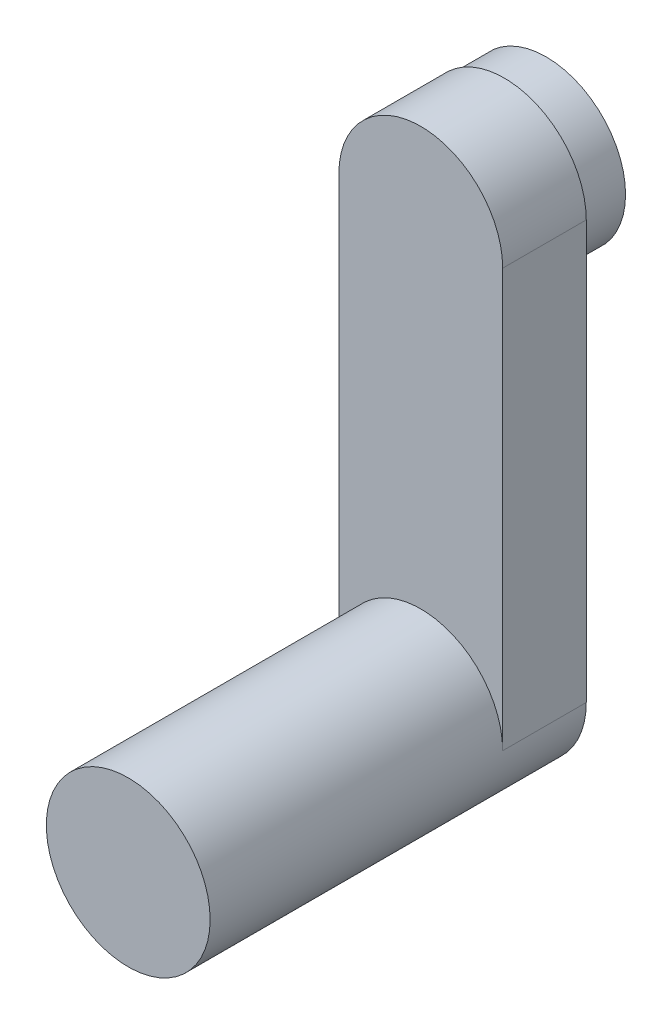
ISO-10303-21;
HEADER;
FILE_DESCRIPTION(('STEP AP214'),'2;1');
FILE_NAME('part.step','',(''),(''),'','','');
FILE_SCHEMA(('AUTOMOTIVE_DESIGN { 1 0 10303 214 1 1 1 1 }'));
ENDSEC;
DATA;
#1=APPLICATION_CONTEXT('core data for automotive mechanical design processes');
#2=APPLICATION_PROTOCOL_DEFINITION('international standard','automotive_design',2000,#1);
#3=PRODUCT_CONTEXT('',#1,'mechanical');
#4=PRODUCT('Part','Part','',(#3));
#5=PRODUCT_RELATED_PRODUCT_CATEGORY('part','',(#4));
#6=PRODUCT_DEFINITION_FORMATION('','',#4);
#7=PRODUCT_DEFINITION_CONTEXT('part definition',#1,'design');
#8=PRODUCT_DEFINITION('design','',#6,#7);
#9=PRODUCT_DEFINITION_SHAPE('','',#8);
#10=(LENGTH_UNIT() NAMED_UNIT(*) SI_UNIT(.MILLI.,.METRE.));
#11=(NAMED_UNIT(*) PLANE_ANGLE_UNIT() SI_UNIT($,.RADIAN.));
#12=(NAMED_UNIT(*) SI_UNIT($,.STERADIAN.) SOLID_ANGLE_UNIT());
#13=UNCERTAINTY_MEASURE_WITH_UNIT(LENGTH_MEASURE(1.E-05),#10,'distance_accuracy_value','');
#14=(GEOMETRIC_REPRESENTATION_CONTEXT(3) GLOBAL_UNCERTAINTY_ASSIGNED_CONTEXT((#13)) GLOBAL_UNIT_ASSIGNED_CONTEXT((#10,
#11,#12)) REPRESENTATION_CONTEXT('',''));
#15=CARTESIAN_POINT('',(0.,0.,0.));
#16=DIRECTION('',(0.,0.,1.));
#17=DIRECTION('',(1.,0.,0.));
#18=AXIS2_PLACEMENT_3D('',#15,#16,#17);
#19=CARTESIAN_POINT('',(0.,0.,175.));
#20=DIRECTION('',(0.,0.,-1.));
#21=DIRECTION('',(-1.,0.,0.));
#22=AXIS2_PLACEMENT_3D('',#19,#20,#21);
#23=CYLINDRICAL_SURFACE('',#22,49.);
#24=CARTESIAN_POINT('',(0.,0.,175.));
#25=DIRECTION('',(0.,0.,1.));
#26=DIRECTION('',(1.,0.,0.));
#27=AXIS2_PLACEMENT_3D('',#24,#25,#26);
#28=CIRCLE('',#27,49.);
#29=CARTESIAN_POINT('',(49.,0.,175.));
#30=VERTEX_POINT('',#29);
#31=EDGE_CURVE('E40',#30,#30,#28,.T.);
#32=ORIENTED_EDGE('',*,*,#31,.F.);
#33=EDGE_LOOP('',(#32));
#34=FACE_BOUND('',#33,.T.);
#35=CARTESIAN_POINT('',(0.,0.,0.));
#36=DIRECTION('',(0.,0.,1.));
#37=DIRECTION('',(1.,0.,0.));
#38=AXIS2_PLACEMENT_3D('',#35,#36,#37);
#39=CIRCLE('',#38,49.);
#40=CARTESIAN_POINT('',(49.,0.,0.));
#41=VERTEX_POINT('',#40);
#42=CARTESIAN_POINT('',(-49.,0.,0.));
#43=VERTEX_POINT('',#42);
#44=EDGE_CURVE('E107',#41,#43,#39,.T.);
#45=ORIENTED_EDGE('',*,*,#44,.T.);
#46=DIRECTION('',(0.,0.,1.));
#47=VECTOR('',#46,1.);
#48=CARTESIAN_POINT('',(-49.,0.,-50.));
#49=LINE('',#48,#47);
#50=CARTESIAN_POINT('',(-49.,0.,-50.));
#51=VERTEX_POINT('',#50);
#52=EDGE_CURVE('E91',#51,#43,#49,.T.);
#53=ORIENTED_EDGE('',*,*,#52,.F.);
#54=CARTESIAN_POINT('',(0.,0.,-50.));
#55=DIRECTION('',(0.,0.,-1.));
#56=DIRECTION('',(-1.,0.,0.));
#57=AXIS2_PLACEMENT_3D('',#54,#55,#56);
#58=CIRCLE('',#57,49.);
#59=CARTESIAN_POINT('',(49.,0.,-50.));
#60=VERTEX_POINT('',#59);
#61=EDGE_CURVE('E85',#60,#51,#58,.T.);
#62=ORIENTED_EDGE('',*,*,#61,.F.);
#63=DIRECTION('',(0.,0.,1.));
#64=VECTOR('',#63,1.);
#65=CARTESIAN_POINT('',(49.,0.,-50.));
#66=LINE('',#65,#64);
#67=EDGE_CURVE('E47',#60,#41,#66,.T.);
#68=ORIENTED_EDGE('',*,*,#67,.T.);
#69=EDGE_LOOP('',(#45,#53,#62,#68));
#70=FACE_BOUND('',#69,.T.);
#71=ADVANCED_FACE('F33',(#34,#70),#23,.T.);
#72=CARTESIAN_POINT('',(0.,0.,175.));
#73=DIRECTION('',(0.,0.,1.));
#74=DIRECTION('',(1.,0.,0.));
#75=AXIS2_PLACEMENT_3D('',#72,#73,#74);
#76=PLANE('',#75);
#77=ORIENTED_EDGE('',*,*,#31,.T.);
#78=EDGE_LOOP('',(#77));
#79=FACE_BOUND('',#78,.T.);
#80=ADVANCED_FACE('F142',(#79),#76,.T.);
#81=CARTESIAN_POINT('',(-49.,0.,-50.));
#82=DIRECTION('',(1.,0.,0.));
#83=DIRECTION('',(0.,0.,-1.));
#84=AXIS2_PLACEMENT_3D('',#81,#82,#83);
#85=PLANE('',#84);
#86=DIRECTION('',(0.,1.,0.));
#87=VECTOR('',#86,1.);
#88=CARTESIAN_POINT('',(-49.,0.,0.));
#89=LINE('',#88,#87);
#90=CARTESIAN_POINT('',(-49.,250.,0.));
#91=VERTEX_POINT('',#90);
#92=EDGE_CURVE('E90',#43,#91,#89,.T.);
#93=ORIENTED_EDGE('',*,*,#92,.T.);
#94=DIRECTION('',(0.,0.,1.));
#95=VECTOR('',#94,1.);
#96=CARTESIAN_POINT('',(-49.,250.,-50.));
#97=LINE('',#96,#95);
#98=CARTESIAN_POINT('',(-49.,250.,-50.));
#99=VERTEX_POINT('',#98);
#100=EDGE_CURVE('E88',#99,#91,#97,.T.);
#101=ORIENTED_EDGE('',*,*,#100,.F.);
#102=DIRECTION('',(0.,1.,0.));
#103=VECTOR('',#102,1.);
#104=CARTESIAN_POINT('',(-49.,0.,-50.));
#105=LINE('',#104,#103);
#106=EDGE_CURVE('E81',#51,#99,#105,.T.);
#107=ORIENTED_EDGE('',*,*,#106,.F.);
#108=ORIENTED_EDGE('',*,*,#52,.T.);
#109=EDGE_LOOP('',(#93,#101,#107,#108));
#110=FACE_BOUND('',#109,.T.);
#111=ADVANCED_FACE('F89',(#110),#85,.F.);
#112=CARTESIAN_POINT('',(0.,250.,-50.));
#113=DIRECTION('',(0.,0.,1.));
#114=DIRECTION('',(1.,0.,0.));
#115=AXIS2_PLACEMENT_3D('',#112,#113,#114);
#116=CYLINDRICAL_SURFACE('',#115,49.);
#117=CARTESIAN_POINT('',(0.,250.,0.));
#118=DIRECTION('',(0.,0.,-1.));
#119=DIRECTION('',(1.,0.,0.));
#120=AXIS2_PLACEMENT_3D('',#117,#118,#119);
#121=CIRCLE('',#120,49.);
#122=CARTESIAN_POINT('',(49.,250.,0.));
#123=VERTEX_POINT('',#122);
#124=EDGE_CURVE('E73',#91,#123,#121,.T.);
#125=ORIENTED_EDGE('',*,*,#124,.T.);
#126=DIRECTION('',(0.,0.,1.));
#127=VECTOR('',#126,1.);
#128=CARTESIAN_POINT('',(49.,250.,-50.));
#129=LINE('',#128,#127);
#130=CARTESIAN_POINT('',(49.,250.,-50.));
#131=VERTEX_POINT('',#130);
#132=EDGE_CURVE('E92',#131,#123,#129,.T.);
#133=ORIENTED_EDGE('',*,*,#132,.F.);
#134=CARTESIAN_POINT('',(0.,250.,-50.));
#135=DIRECTION('',(0.,0.,-1.));
#136=DIRECTION('',(1.,0.,0.));
#137=AXIS2_PLACEMENT_3D('',#134,#135,#136);
#138=CIRCLE('',#137,49.);
#139=EDGE_CURVE('E84',#99,#131,#138,.T.);
#140=ORIENTED_EDGE('',*,*,#139,.F.);
#141=ORIENTED_EDGE('',*,*,#100,.T.);
#142=EDGE_LOOP('',(#125,#133,#140,#141));
#143=FACE_BOUND('',#142,.T.);
#144=ADVANCED_FACE('F94',(#143),#116,.T.);
#145=CARTESIAN_POINT('',(49.,0.,-50.));
#146=DIRECTION('',(-1.,0.,0.));
#147=DIRECTION('',(0.,0.,1.));
#148=AXIS2_PLACEMENT_3D('',#145,#146,#147);
#149=PLANE('',#148);
#150=DIRECTION('',(0.,-1.,0.));
#151=VECTOR('',#150,1.);
#152=CARTESIAN_POINT('',(49.,0.,0.));
#153=LINE('',#152,#151);
#154=EDGE_CURVE('E102',#123,#41,#153,.T.);
#155=ORIENTED_EDGE('',*,*,#154,.T.);
#156=ORIENTED_EDGE('',*,*,#67,.F.);
#157=DIRECTION('',(0.,-1.,0.));
#158=VECTOR('',#157,1.);
#159=CARTESIAN_POINT('',(49.,0.,-50.));
#160=LINE('',#159,#158);
#161=EDGE_CURVE('E56',#131,#60,#160,.T.);
#162=ORIENTED_EDGE('',*,*,#161,.F.);
#163=ORIENTED_EDGE('',*,*,#132,.T.);
#164=EDGE_LOOP('',(#155,#156,#162,#163));
#165=FACE_BOUND('',#164,.T.);
#166=ADVANCED_FACE('F114',(#165),#149,.F.);
#167=CARTESIAN_POINT('',(0.,0.,-50.));
#168=DIRECTION('',(0.,0.,-1.));
#169=DIRECTION('',(-1.,0.,0.));
#170=AXIS2_PLACEMENT_3D('',#167,#168,#169);
#171=PLANE('',#170);
#172=CARTESIAN_POINT('',(0.,250.,-50.));
#173=DIRECTION('',(0.,0.,-1.));
#174=DIRECTION('',(-1.,0.,0.));
#175=AXIS2_PLACEMENT_3D('',#172,#173,#174);
#176=CIRCLE('',#175,47.5);
#177=CARTESIAN_POINT('',(-47.5,250.,-50.));
#178=VERTEX_POINT('',#177);
#179=EDGE_CURVE('E116',#178,#178,#176,.T.);
#180=ORIENTED_EDGE('',*,*,#179,.F.);
#181=EDGE_LOOP('',(#180));
#182=FACE_BOUND('',#181,.T.);
#183=ORIENTED_EDGE('',*,*,#61,.T.);
#184=ORIENTED_EDGE('',*,*,#106,.T.);
#185=ORIENTED_EDGE('',*,*,#139,.T.);
#186=ORIENTED_EDGE('',*,*,#161,.T.);
#187=EDGE_LOOP('',(#183,#184,#185,#186));
#188=FACE_BOUND('',#187,.T.);
#189=ADVANCED_FACE('F82',(#182,#188),#171,.T.);
#190=CARTESIAN_POINT('',(0.,0.,0.));
#191=DIRECTION('',(0.,0.,-1.));
#192=DIRECTION('',(-1.,0.,0.));
#193=AXIS2_PLACEMENT_3D('',#190,#191,#192);
#194=PLANE('',#193);
#195=ORIENTED_EDGE('',*,*,#44,.F.);
#196=ORIENTED_EDGE('',*,*,#154,.F.);
#197=ORIENTED_EDGE('',*,*,#124,.F.);
#198=ORIENTED_EDGE('',*,*,#92,.F.);
#199=EDGE_LOOP('',(#195,#196,#197,#198));
#200=FACE_BOUND('',#199,.T.);
#201=ADVANCED_FACE('F112',(#200),#194,.F.);
#202=CARTESIAN_POINT('',(0.,250.,-75.));
#203=DIRECTION('',(0.,0.,-1.));
#204=DIRECTION('',(-1.,0.,0.));
#205=AXIS2_PLACEMENT_3D('',#202,#203,#204);
#206=PLANE('',#205);
#207=CARTESIAN_POINT('',(0.,250.,-75.));
#208=DIRECTION('',(0.,0.,-1.));
#209=DIRECTION('',(-1.,0.,0.));
#210=AXIS2_PLACEMENT_3D('',#207,#208,#209);
#211=CIRCLE('',#210,47.5);
#212=CARTESIAN_POINT('',(-47.5,250.,-75.));
#213=VERTEX_POINT('',#212);
#214=EDGE_CURVE('E100',#213,#213,#211,.T.);
#215=ORIENTED_EDGE('',*,*,#214,.T.);
#216=EDGE_LOOP('',(#215));
#217=FACE_BOUND('',#216,.T.);
#218=CARTESIAN_POINT('',(0.,250.,-75.));
#219=DIRECTION('',(0.,0.,-1.));
#220=DIRECTION('',(-1.,0.,0.));
#221=AXIS2_PLACEMENT_3D('',#218,#219,#220);
#222=CIRCLE('',#221,45.);
#223=CARTESIAN_POINT('',(-45.,250.,-75.));
#224=VERTEX_POINT('',#223);
#225=EDGE_CURVE('E119',#224,#224,#222,.T.);
#226=ORIENTED_EDGE('',*,*,#225,.F.);
#227=EDGE_LOOP('',(#226));
#228=FACE_BOUND('',#227,.T.);
#229=ADVANCED_FACE('F128',(#217,#228),#206,.T.);
#230=CARTESIAN_POINT('',(0.,250.,-75.));
#231=DIRECTION('',(0.,0.,1.));
#232=DIRECTION('',(1.,0.,0.));
#233=AXIS2_PLACEMENT_3D('',#230,#231,#232);
#234=CYLINDRICAL_SURFACE('',#233,47.5);
#235=ORIENTED_EDGE('',*,*,#214,.F.);
#236=EDGE_LOOP('',(#235));
#237=FACE_BOUND('',#236,.T.);
#238=ORIENTED_EDGE('',*,*,#179,.T.);
#239=EDGE_LOOP('',(#238));
#240=FACE_BOUND('',#239,.T.);
#241=ADVANCED_FACE('F130',(#237,#240),#234,.T.);
#242=CARTESIAN_POINT('',(0.,250.,-75.));
#243=DIRECTION('',(0.,0.,1.));
#244=DIRECTION('',(1.,0.,0.));
#245=AXIS2_PLACEMENT_3D('',#242,#243,#244);
#246=CYLINDRICAL_SURFACE('',#245,45.);
#247=ORIENTED_EDGE('',*,*,#225,.T.);
#248=EDGE_LOOP('',(#247));
#249=FACE_BOUND('',#248,.T.);
#250=CARTESIAN_POINT('',(0.,250.,-50.));
#251=DIRECTION('',(0.,0.,-1.));
#252=DIRECTION('',(-1.,0.,0.));
#253=AXIS2_PLACEMENT_3D('',#250,#251,#252);
#254=CIRCLE('',#253,45.);
#255=CARTESIAN_POINT('',(-45.,250.,-50.));
#256=VERTEX_POINT('',#255);
#257=EDGE_CURVE('E11',#256,#256,#254,.F.);
#258=ORIENTED_EDGE('',*,*,#257,.T.);
#259=EDGE_LOOP('',(#258));
#260=FACE_BOUND('',#259,.T.);
#261=ADVANCED_FACE('F125',(#249,#260),#246,.F.);
#262=ORIENTED_EDGE('',*,*,#257,.F.);
#263=EDGE_LOOP('',(#262));
#264=FACE_BOUND('',#263,.T.);
#265=ADVANCED_FACE('F160',(#264),#171,.T.);
#266=CLOSED_SHELL('',(#71,#80,#111,#144,#166,#189,#201,#229,#241,#261,#265));
#267=MANIFOLD_SOLID_BREP('B2',#266);
#268=ADVANCED_BREP_SHAPE_REPRESENTATION('',(#18,#267),#14);
#269=SHAPE_DEFINITION_REPRESENTATION(#9,#268);
ENDSEC;
END-ISO-10303-21;
